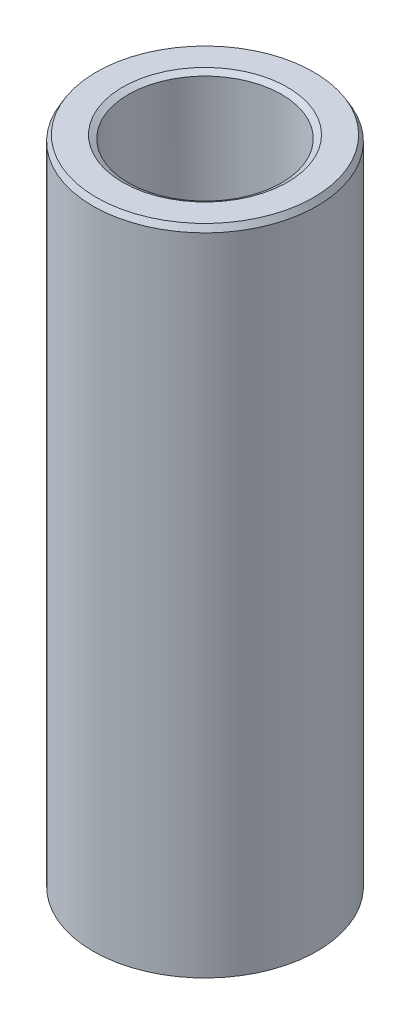
ISO-10303-21;
HEADER;
FILE_DESCRIPTION(('STEP AP214'),'2;1');
FILE_NAME('part.step','',(''),(''),'','','');
FILE_SCHEMA(('AUTOMOTIVE_DESIGN { 1 0 10303 214 1 1 1 1 }'));
ENDSEC;
DATA;
#1=APPLICATION_CONTEXT('core data for automotive mechanical design processes');
#2=APPLICATION_PROTOCOL_DEFINITION('international standard','automotive_design',2000,#1);
#3=PRODUCT_CONTEXT('',#1,'mechanical');
#4=PRODUCT('Part','Part','',(#3));
#5=PRODUCT_RELATED_PRODUCT_CATEGORY('part','',(#4));
#6=PRODUCT_DEFINITION_FORMATION('','',#4);
#7=PRODUCT_DEFINITION_CONTEXT('part definition',#1,'design');
#8=PRODUCT_DEFINITION('design','',#6,#7);
#9=PRODUCT_DEFINITION_SHAPE('','',#8);
#10=(LENGTH_UNIT() NAMED_UNIT(*) SI_UNIT(.MILLI.,.METRE.));
#11=(NAMED_UNIT(*) PLANE_ANGLE_UNIT() SI_UNIT($,.RADIAN.));
#12=(NAMED_UNIT(*) SI_UNIT($,.STERADIAN.) SOLID_ANGLE_UNIT());
#13=UNCERTAINTY_MEASURE_WITH_UNIT(LENGTH_MEASURE(1.E-05),#10,'distance_accuracy_value','');
#14=(GEOMETRIC_REPRESENTATION_CONTEXT(3) GLOBAL_UNCERTAINTY_ASSIGNED_CONTEXT((#13)) GLOBAL_UNIT_ASSIGNED_CONTEXT((#10,
#11,#12)) REPRESENTATION_CONTEXT('',''));
#15=CARTESIAN_POINT('',(0.,0.,0.));
#16=DIRECTION('',(0.,0.,1.));
#17=DIRECTION('',(1.,0.,0.));
#18=AXIS2_PLACEMENT_3D('',#15,#16,#17);
#19=CARTESIAN_POINT('',(0.,160.655673121724,0.));
#20=DIRECTION('',(0.,-1.,0.));
#21=DIRECTION('',(0.,0.,-1.));
#22=AXIS2_PLACEMENT_3D('',#19,#20,#21);
#23=CYLINDRICAL_SURFACE('',#22,27.5);
#24=CARTESIAN_POINT('',(0.,0.825944551718943,0.));
#25=DIRECTION('',(0.,1.,0.));
#26=DIRECTION('',(0.,0.,1.));
#27=AXIS2_PLACEMENT_3D('',#24,#25,#26);
#28=CIRCLE('',#27,27.5);
#29=CARTESIAN_POINT('',(0.,0.825944551718943,27.5));
#30=VERTEX_POINT('',#29);
#31=EDGE_CURVE('E10',#30,#30,#28,.T.);
#32=ORIENTED_EDGE('',*,*,#31,.T.);
#33=EDGE_LOOP('',(#32));
#34=FACE_BOUND('',#33,.T.);
#35=CARTESIAN_POINT('',(0.,159.225095193912,0.));
#36=DIRECTION('',(0.,1.,0.));
#37=DIRECTION('',(0.,0.,1.));
#38=AXIS2_PLACEMENT_3D('',#35,#36,#37);
#39=CIRCLE('',#38,27.5);
#40=CARTESIAN_POINT('',(0.,159.225095193912,27.5));
#41=VERTEX_POINT('',#40);
#42=EDGE_CURVE('E50',#41,#41,#39,.F.);
#43=ORIENTED_EDGE('',*,*,#42,.T.);
#44=EDGE_LOOP('',(#43));
#45=FACE_BOUND('',#44,.T.);
#46=ADVANCED_FACE('F39',(#34,#45),#23,.T.);
#47=CARTESIAN_POINT('',(0.,160.655673121724,0.));
#48=DIRECTION('',(0.,1.,0.));
#49=DIRECTION('',(0.,0.,1.));
#50=AXIS2_PLACEMENT_3D('',#47,#48,#49);
#51=PLANE('',#50);
#52=CARTESIAN_POINT('',(0.,160.655673121724,0.));
#53=DIRECTION('',(0.,1.,0.));
#54=DIRECTION('',(0.,0.,1.));
#55=AXIS2_PLACEMENT_3D('',#52,#53,#54);
#56=CIRCLE('',#55,20.2337938311965);
#57=CARTESIAN_POINT('',(0.,160.655673121724,20.2337938311965));
#58=VERTEX_POINT('',#57);
#59=EDGE_CURVE('E58',#58,#58,#56,.F.);
#60=ORIENTED_EDGE('',*,*,#59,.T.);
#61=EDGE_LOOP('',(#60));
#62=FACE_BOUND('',#61,.T.);
#63=CARTESIAN_POINT('',(0.,160.655673121724,0.));
#64=DIRECTION('',(0.,1.,0.));
#65=DIRECTION('',(0.,0.,1.));
#66=AXIS2_PLACEMENT_3D('',#63,#64,#65);
#67=CIRCLE('',#66,26.6740554482811);
#68=CARTESIAN_POINT('',(0.,160.655673121724,26.6740554482811));
#69=VERTEX_POINT('',#68);
#70=EDGE_CURVE('E61',#69,#69,#67,.T.);
#71=ORIENTED_EDGE('',*,*,#70,.T.);
#72=EDGE_LOOP('',(#71));
#73=FACE_BOUND('',#72,.T.);
#74=ADVANCED_FACE('F88',(#62,#73),#51,.T.);
#75=CARTESIAN_POINT('',(0.,0.,0.));
#76=DIRECTION('',(0.,1.,0.));
#77=DIRECTION('',(0.,0.,1.));
#78=AXIS2_PLACEMENT_3D('',#75,#76,#77);
#79=PLANE('',#78);
#80=CARTESIAN_POINT('',(0.,0.,0.));
#81=DIRECTION('',(0.,1.,0.));
#82=DIRECTION('',(0.,0.,1.));
#83=AXIS2_PLACEMENT_3D('',#80,#81,#82);
#84=CIRCLE('',#83,19.6291604551035);
#85=CARTESIAN_POINT('',(0.,0.,-19.6291604551035));
#86=VERTEX_POINT('',#85);
#87=EDGE_CURVE('E51',#86,#86,#84,.T.);
#88=ORIENTED_EDGE('',*,*,#87,.T.);
#89=EDGE_LOOP('',(#88));
#90=FACE_BOUND('',#89,.T.);
#91=CARTESIAN_POINT('',(0.,0.,0.));
#92=DIRECTION('',(0.,1.,0.));
#93=DIRECTION('',(0.,0.,1.));
#94=AXIS2_PLACEMENT_3D('',#91,#92,#93);
#95=CIRCLE('',#94,26.069422072188);
#96=CARTESIAN_POINT('',(0.,0.,26.069422072188));
#97=VERTEX_POINT('',#96);
#98=EDGE_CURVE('E54',#97,#97,#95,.F.);
#99=ORIENTED_EDGE('',*,*,#98,.T.);
#100=EDGE_LOOP('',(#99));
#101=FACE_BOUND('',#100,.T.);
#102=ADVANCED_FACE('F83',(#90,#101),#79,.F.);
#103=CARTESIAN_POINT('',(0.,160.655673121724,0.));
#104=DIRECTION('',(0.,-1.,0.));
#105=DIRECTION('',(0.,0.,-1.));
#106=AXIS2_PLACEMENT_3D('',#103,#104,#105);
#107=CYLINDRICAL_SURFACE('',#106,18.8032159033846);
#108=CARTESIAN_POINT('',(0.,159.829728570005,0.));
#109=DIRECTION('',(0.,1.,0.));
#110=DIRECTION('',(0.,0.,1.));
#111=AXIS2_PLACEMENT_3D('',#108,#109,#110);
#112=CIRCLE('',#111,18.8032159033846);
#113=CARTESIAN_POINT('',(0.,159.829728570005,18.8032159033846));
#114=VERTEX_POINT('',#113);
#115=EDGE_CURVE('E67',#114,#114,#112,.T.);
#116=ORIENTED_EDGE('',*,*,#115,.T.);
#117=EDGE_LOOP('',(#116));
#118=FACE_BOUND('',#117,.T.);
#119=CARTESIAN_POINT('',(0.,1.43057792781195,0.));
#120=DIRECTION('',(0.,1.,0.));
#121=DIRECTION('',(0.,0.,1.));
#122=AXIS2_PLACEMENT_3D('',#119,#120,#121);
#123=CIRCLE('',#122,18.8032159033846);
#124=CARTESIAN_POINT('',(0.,1.43057792781195,-18.8032159033846));
#125=VERTEX_POINT('',#124);
#126=EDGE_CURVE('E69',#125,#125,#123,.F.);
#127=ORIENTED_EDGE('',*,*,#126,.T.);
#128=EDGE_LOOP('',(#127));
#129=FACE_BOUND('',#128,.T.);
#130=ADVANCED_FACE('F71',(#118,#129),#107,.F.);
#131=CARTESIAN_POINT('',(0.,159.829728570005,0.));
#132=DIRECTION('',(0.,1.,0.));
#133=DIRECTION('',(0.,0.,1.));
#134=AXIS2_PLACEMENT_3D('',#131,#132,#133);
#135=CONICAL_SURFACE('',#134,18.8032159033846,1.04719755119659);
#136=ORIENTED_EDGE('',*,*,#59,.F.);
#137=EDGE_LOOP('',(#136));
#138=FACE_BOUND('',#137,.T.);
#139=ORIENTED_EDGE('',*,*,#115,.F.);
#140=EDGE_LOOP('',(#139));
#141=FACE_BOUND('',#140,.T.);
#142=ADVANCED_FACE('F77',(#138,#141),#135,.F.);
#143=CARTESIAN_POINT('',(0.,0.,0.));
#144=DIRECTION('',(0.,-1.,0.));
#145=DIRECTION('',(0.,0.,-1.));
#146=AXIS2_PLACEMENT_3D('',#143,#144,#145);
#147=CONICAL_SURFACE('',#146,19.6291604551035,0.523598775598291);
#148=CARTESIAN_POINT('',(0.,1.43057792781195,-18.8032159033846));
#149=CARTESIAN_POINT('',(0.,1.41567607439725,-18.811819492465));
#150=CARTESIAN_POINT('',(0.,1.40077422098254,-18.8204230815454));
#151=CARTESIAN_POINT('',(0.,1.37097051415312,-18.8376302597062));
#152=CARTESIAN_POINT('',(0.,1.35606866073842,-18.8462338487866));
#153=CARTESIAN_POINT('',(0.,1.326264953909,-18.8634410269474));
#154=CARTESIAN_POINT('',(0.,1.31136310049429,-18.8720446160278));
#155=CARTESIAN_POINT('',(0.,1.28155939366488,-18.8892517941886));
#156=CARTESIAN_POINT('',(0.,1.26665754025017,-18.8978553832691));
#157=CARTESIAN_POINT('',(0.,1.23685383342075,-18.9150625614299));
#158=CARTESIAN_POINT('',(0.,1.22195198000604,-18.9236661505103));
#159=CARTESIAN_POINT('',(0.,1.19214827317663,-18.9408733286711));
#160=CARTESIAN_POINT('',(0.,1.17724641976192,-18.9494769177515));
#161=CARTESIAN_POINT('',(0.,1.1474427129325,-18.9666840959123));
#162=CARTESIAN_POINT('',(0.,1.1325408595178,-18.9752876849927));
#163=CARTESIAN_POINT('',(0.,1.10273715268838,-18.9924948631535));
#164=CARTESIAN_POINT('',(0.,1.08783529927367,-19.0010984522339));
#165=CARTESIAN_POINT('',(0.,1.05803159244426,-19.0183056303947));
#166=CARTESIAN_POINT('',(0.,1.04312973902955,-19.0269092194751));
#167=CARTESIAN_POINT('',(0.,1.01332603220013,-19.044116397636));
#168=CARTESIAN_POINT('',(0.,0.998424178785426,-19.0527199867164));
#169=CARTESIAN_POINT('',(0.,0.968620471956011,-19.0699271648772));
#170=CARTESIAN_POINT('',(0.,0.953718618541303,-19.0785307539576));
#171=CARTESIAN_POINT('',(0.,0.923914911711888,-19.0957379321184));
#172=CARTESIAN_POINT('',(0.,0.90901305829718,-19.1043415211988));
#173=CARTESIAN_POINT('',(0.,0.879209351467763,-19.1215486993596));
#174=CARTESIAN_POINT('',(0.,0.864307498053055,-19.13015228844));
#175=CARTESIAN_POINT('',(0.,0.83450379122364,-19.1473594666008));
#176=CARTESIAN_POINT('',(0.,0.819601937808932,-19.1559630556812));
#177=CARTESIAN_POINT('',(0.,0.789798230979517,-19.173170233842));
#178=CARTESIAN_POINT('',(0.,0.774896377564809,-19.1817738229224));
#179=CARTESIAN_POINT('',(0.,0.745092670735393,-19.1989810010833));
#180=CARTESIAN_POINT('',(0.,0.730190817320685,-19.2075845901637));
#181=CARTESIAN_POINT('',(0.,0.700387110491269,-19.2247917683245));
#182=CARTESIAN_POINT('',(0.,0.685485257076562,-19.2333953574049));
#183=CARTESIAN_POINT('',(0.,0.655681550247146,-19.2506025355657));
#184=CARTESIAN_POINT('',(0.,0.640779696832438,-19.2592061246461));
#185=CARTESIAN_POINT('',(0.,0.610975990003022,-19.2764133028069));
#186=CARTESIAN_POINT('',(0.,0.596074136588314,-19.2850168918873));
#187=CARTESIAN_POINT('',(0.,0.566270429758899,-19.3022240700481));
#188=CARTESIAN_POINT('',(0.,0.551368576344191,-19.3108276591285));
#189=CARTESIAN_POINT('',(0.,0.521564869514775,-19.3280348372893));
#190=CARTESIAN_POINT('',(0.,0.506663016100067,-19.3366384263697));
#191=CARTESIAN_POINT('',(0.,0.476859309270651,-19.3538456045306));
#192=CARTESIAN_POINT('',(0.,0.461957455855944,-19.362449193611));
#193=CARTESIAN_POINT('',(0.,0.432153749026528,-19.3796563717718));
#194=CARTESIAN_POINT('',(0.,0.41725189561182,-19.3882599608522));
#195=CARTESIAN_POINT('',(0.,0.387448188782404,-19.405467139013));
#196=CARTESIAN_POINT('',(0.,0.372546335367696,-19.4140707280934));
#197=CARTESIAN_POINT('',(0.,0.342742628538281,-19.4312779062542));
#198=CARTESIAN_POINT('',(0.,0.327840775123573,-19.4398814953346));
#199=CARTESIAN_POINT('',(0.,0.298037068294157,-19.4570886734954));
#200=CARTESIAN_POINT('',(0.,0.283135214879449,-19.4656922625758));
#201=CARTESIAN_POINT('',(0.,0.253331508050033,-19.4828994407366));
#202=CARTESIAN_POINT('',(0.,0.238429654635325,-19.4915030298171));
#203=CARTESIAN_POINT('',(0.,0.20862594780591,-19.5087102079779));
#204=CARTESIAN_POINT('',(0.,0.193724094391202,-19.5173137970583));
#205=CARTESIAN_POINT('',(0.,0.163920387561787,-19.5345209752191));
#206=CARTESIAN_POINT('',(0.,0.149018534147079,-19.5431245642995));
#207=CARTESIAN_POINT('',(0.,0.119214827317663,-19.5603317424603));
#208=CARTESIAN_POINT('',(0.,0.104312973902955,-19.5689353315407));
#209=CARTESIAN_POINT('',(0.,0.0745092670735391,-19.5861425097015));
#210=CARTESIAN_POINT('',(0.,0.0596074136588315,-19.5947460987819));
#211=CARTESIAN_POINT('',(0.,0.0298037068294162,-19.6119532769427));
#212=CARTESIAN_POINT('',(0.,0.0149018534147086,-19.6205568660231));
#213=CARTESIAN_POINT('',(0.,0.,-19.6291604551035));
#214=B_SPLINE_CURVE_WITH_KNOTS('',3,(#148,#149,#150,#151,#152,#153,#154,#155,#156,#157,#158,
#159,#160,#161,#162,#163,#164,#165,#166,#167,#168,#169,#170,#171,#172,#173,#174,#175,#176,#177,
#178,#179,#180,#181,#182,#183,#184,#185,#186,#187,#188,#189,#190,#191,#192,#193,#194,#195,#196,
#197,#198,#199,#200,#201,#202,#203,#204,#205,#206,#207,#208,#209,#210,#211,#212,#213),
.UNSPECIFIED.,.F.,.F.,(4,2,2,2,2,2,2,2,2,2,2,2,2,2,2,2,2,2,2,2,2,2,2,2,2,2,2,2,2,2,2,2,4),(0.,
0.0516215344824347,0.103243068964871,0.154864603447306,0.206486137929741,0.258107672412177,
0.309729206894612,0.361350741377047,0.412972275859483,0.464593810341918,0.516215344824352,
0.567836879306789,0.619458413789224,0.671079948271658,0.722701482754095,0.77432301723653,
0.825944551718964,0.877566086201401,0.929187620683835,0.980809155166272,1.03243068964871,
1.08405222413114,1.13567375861358,1.18729529309601,1.23891682757845,1.29053836206088,
1.34215989654332,1.39378143102575,1.44540296550819,1.49702449999063,1.54864603447306,
1.6002675689555,1.65188910343793),.UNSPECIFIED.);
#215=EDGE_CURVE('BSEAM73',#125,#86,#214,.T.);
#216=ORIENTED_EDGE('',*,*,#126,.F.);
#217=ORIENTED_EDGE('',*,*,#87,.F.);
#218=ORIENTED_EDGE('',*,*,#215,.T.);
#219=ORIENTED_EDGE('',*,*,#215,.F.);
#220=EDGE_LOOP('',(#216,#218,#217,#219));
#221=FACE_BOUND('',#220,.T.);
#222=ADVANCED_FACE('F73',(#221),#147,.F.);
#223=CARTESIAN_POINT('',(0.,0.825944551718943,0.));
#224=DIRECTION('',(0.,1.,0.));
#225=DIRECTION('',(0.,0.,1.));
#226=AXIS2_PLACEMENT_3D('',#223,#224,#225);
#227=CONICAL_SURFACE('',#226,27.5,1.04719755119661);
#228=ORIENTED_EDGE('',*,*,#98,.F.);
#229=EDGE_LOOP('',(#228));
#230=FACE_BOUND('',#229,.T.);
#231=ORIENTED_EDGE('',*,*,#31,.F.);
#232=EDGE_LOOP('',(#231));
#233=FACE_BOUND('',#232,.T.);
#234=ADVANCED_FACE('F76',(#230,#233),#227,.T.);
#235=CARTESIAN_POINT('',(0.,160.655673121724,0.));
#236=DIRECTION('',(0.,-1.,0.));
#237=DIRECTION('',(0.,0.,-1.));
#238=AXIS2_PLACEMENT_3D('',#235,#236,#237);
#239=CONICAL_SURFACE('',#238,26.6740554482811,0.523598775598288);
#240=ORIENTED_EDGE('',*,*,#42,.F.);
#241=EDGE_LOOP('',(#240));
#242=FACE_BOUND('',#241,.T.);
#243=ORIENTED_EDGE('',*,*,#70,.F.);
#244=EDGE_LOOP('',(#243));
#245=FACE_BOUND('',#244,.T.);
#246=ADVANCED_FACE('F45',(#242,#245),#239,.T.);
#247=CLOSED_SHELL('',(#46,#74,#102,#130,#142,#222,#234,#246));
#248=MANIFOLD_SOLID_BREP('B2',#247);
#249=ADVANCED_BREP_SHAPE_REPRESENTATION('',(#18,#248),#14);
#250=SHAPE_DEFINITION_REPRESENTATION(#9,#249);
ENDSEC;
END-ISO-10303-21;
